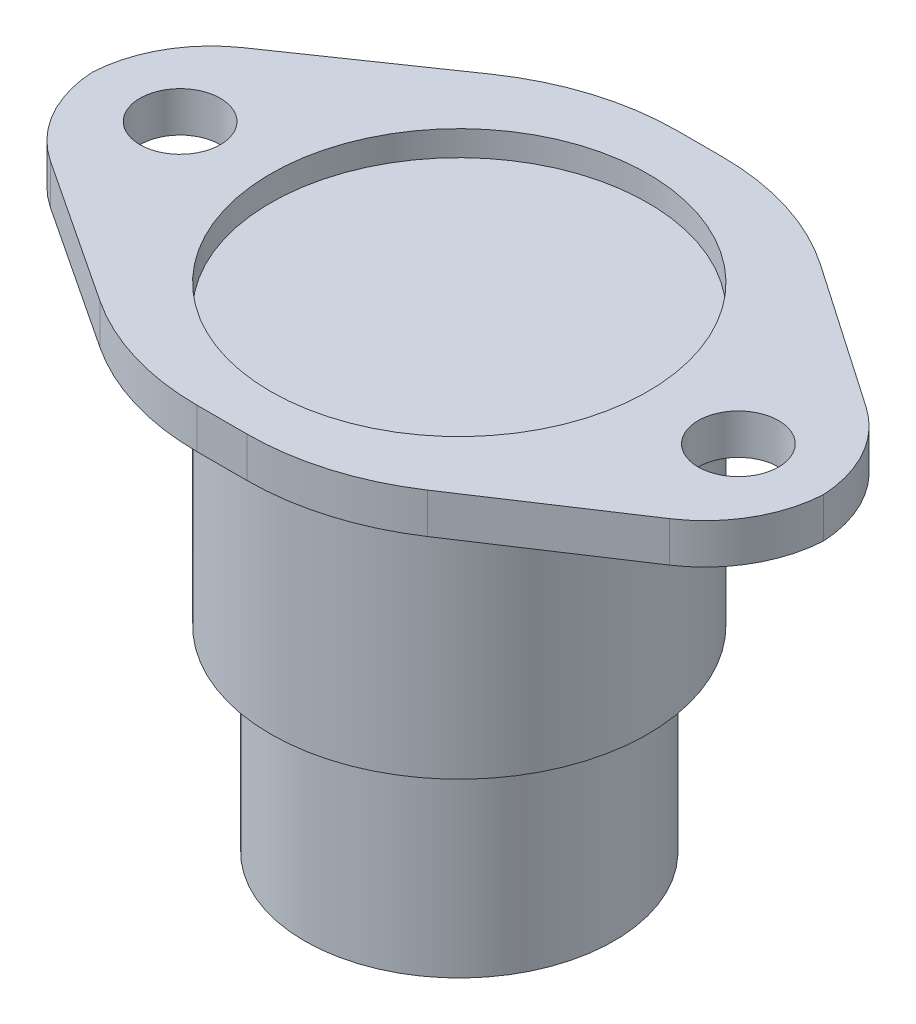
ISO-10303-21;
HEADER;
FILE_DESCRIPTION(('STEP AP214'),'2;1');
FILE_NAME('part.step','',(''),(''),'','','');
FILE_SCHEMA(('AUTOMOTIVE_DESIGN { 1 0 10303 214 1 1 1 1 }'));
ENDSEC;
DATA;
#1=APPLICATION_CONTEXT('core data for automotive mechanical design processes');
#2=APPLICATION_PROTOCOL_DEFINITION('international standard','automotive_design',2000,#1);
#3=PRODUCT_CONTEXT('',#1,'mechanical');
#4=PRODUCT('Part','Part','',(#3));
#5=PRODUCT_RELATED_PRODUCT_CATEGORY('part','',(#4));
#6=PRODUCT_DEFINITION_FORMATION('','',#4);
#7=PRODUCT_DEFINITION_CONTEXT('part definition',#1,'design');
#8=PRODUCT_DEFINITION('design','',#6,#7);
#9=PRODUCT_DEFINITION_SHAPE('','',#8);
#10=(LENGTH_UNIT() NAMED_UNIT(*) SI_UNIT(.MILLI.,.METRE.));
#11=(NAMED_UNIT(*) PLANE_ANGLE_UNIT() SI_UNIT($,.RADIAN.));
#12=(NAMED_UNIT(*) SI_UNIT($,.STERADIAN.) SOLID_ANGLE_UNIT());
#13=UNCERTAINTY_MEASURE_WITH_UNIT(LENGTH_MEASURE(1.E-05),#10,'distance_accuracy_value','');
#14=(GEOMETRIC_REPRESENTATION_CONTEXT(3) GLOBAL_UNCERTAINTY_ASSIGNED_CONTEXT((#13)) GLOBAL_UNIT_ASSIGNED_CONTEXT((#10,
#11,#12)) REPRESENTATION_CONTEXT('',''));
#15=CARTESIAN_POINT('',(0.,0.,0.));
#16=DIRECTION('',(0.,0.,1.));
#17=DIRECTION('',(1.,0.,0.));
#18=AXIS2_PLACEMENT_3D('',#15,#16,#17);
#19=CARTESIAN_POINT('',(0.,0.,0.));
#20=DIRECTION('',(0.,1.,0.));
#21=DIRECTION('',(0.,0.,1.));
#22=AXIS2_PLACEMENT_3D('',#19,#20,#21);
#23=PLANE('',#22);
#24=CARTESIAN_POINT('',(0.,0.,0.));
#25=DIRECTION('',(0.,1.,0.));
#26=DIRECTION('',(0.,0.,1.));
#27=AXIS2_PLACEMENT_3D('',#24,#25,#26);
#28=CIRCLE('',#27,7.5);
#29=CARTESIAN_POINT('',(0.,0.,7.5));
#30=VERTEX_POINT('',#29);
#31=EDGE_CURVE('E177',#30,#30,#28,.T.);
#32=ORIENTED_EDGE('',*,*,#31,.F.);
#33=EDGE_LOOP('',(#32));
#34=FACE_BOUND('',#33,.T.);
#35=CARTESIAN_POINT('',(0.,0.,0.));
#36=DIRECTION('',(0.,1.,0.));
#37=DIRECTION('',(0.,0.,1.));
#38=AXIS2_PLACEMENT_3D('',#35,#36,#37);
#39=CIRCLE('',#38,6.15);
#40=CARTESIAN_POINT('',(0.,0.,6.15));
#41=VERTEX_POINT('',#40);
#42=EDGE_CURVE('E158',#41,#41,#39,.F.);
#43=ORIENTED_EDGE('',*,*,#42,.F.);
#44=EDGE_LOOP('',(#43));
#45=FACE_BOUND('',#44,.T.);
#46=ADVANCED_FACE('F34',(#34,#45),#23,.F.);
#47=CARTESIAN_POINT('',(0.,10.2,0.));
#48=DIRECTION('',(0.,-1.,0.));
#49=DIRECTION('',(0.,0.,-1.));
#50=AXIS2_PLACEMENT_3D('',#47,#48,#49);
#51=CYLINDRICAL_SURFACE('',#50,7.5);
#52=CARTESIAN_POINT('',(0.,10.2,0.));
#53=DIRECTION('',(0.,1.,0.));
#54=DIRECTION('',(0.,0.,1.));
#55=AXIS2_PLACEMENT_3D('',#52,#53,#54);
#56=CIRCLE('',#55,7.5);
#57=CARTESIAN_POINT('',(0.,10.2,7.5));
#58=VERTEX_POINT('',#57);
#59=EDGE_CURVE('E174',#58,#58,#56,.T.);
#60=ORIENTED_EDGE('',*,*,#59,.F.);
#61=EDGE_LOOP('',(#60));
#62=FACE_BOUND('',#61,.T.);
#63=ORIENTED_EDGE('',*,*,#31,.T.);
#64=EDGE_LOOP('',(#63));
#65=FACE_BOUND('',#64,.T.);
#66=ADVANCED_FACE('F310',(#62,#65),#51,.T.);
#67=CARTESIAN_POINT('',(0.,10.2,0.));
#68=DIRECTION('',(0.,-1.,0.));
#69=DIRECTION('',(0.,0.,-1.));
#70=AXIS2_PLACEMENT_3D('',#67,#68,#69);
#71=PLANE('',#70);
#72=CARTESIAN_POINT('',(11.1,10.2,0.));
#73=DIRECTION('',(0.,1.,0.));
#74=DIRECTION('',(0.,0.,1.));
#75=AXIS2_PLACEMENT_3D('',#72,#73,#74);
#76=CIRCLE('',#75,1.6);
#77=CARTESIAN_POINT('',(11.1,10.2,1.6));
#78=VERTEX_POINT('',#77);
#79=EDGE_CURVE('E268',#78,#78,#76,.T.);
#80=ORIENTED_EDGE('',*,*,#79,.T.);
#81=EDGE_LOOP('',(#80));
#82=FACE_BOUND('',#81,.T.);
#83=DIRECTION('',(-1.,0.,0.));
#84=VECTOR('',#83,1.);
#85=CARTESIAN_POINT('',(4.,10.2,-9.56519593975598));
#86=LINE('',#85,#84);
#87=CARTESIAN_POINT('',(0.892310282869016,10.2,-9.56519593975598));
#88=VERTEX_POINT('',#87);
#89=CARTESIAN_POINT('',(-0.892310282869017,10.2,-9.56519593975598));
#90=VERTEX_POINT('',#89);
#91=EDGE_CURVE('E164',#88,#90,#86,.T.);
#92=ORIENTED_EDGE('',*,*,#91,.F.);
#93=CARTESIAN_POINT('',(0.892310282869016,10.2,0.434804060244022));
#94=DIRECTION('',(0.,-1.,0.));
#95=DIRECTION('',(0.,0.,-1.));
#96=AXIS2_PLACEMENT_3D('',#93,#94,#95);
#97=CIRCLE('',#96,10.);
#98=CARTESIAN_POINT('',(6.56029112602538,10.2,-7.80376336143874));
#99=VERTEX_POINT('',#98);
#100=EDGE_CURVE('E163',#88,#99,#97,.T.);
#101=ORIENTED_EDGE('',*,*,#100,.T.);
#102=DIRECTION('',(-0.823856742168276,0.,-0.566798084315636));
#103=VECTOR('',#102,1.);
#104=CARTESIAN_POINT('',(14.55,10.2,-2.30699256110524));
#105=LINE('',#104,#103);
#106=CARTESIAN_POINT('',(12.3839904215782,10.2,-3.79716678293378));
#107=VERTEX_POINT('',#106);
#108=EDGE_CURVE('E153',#107,#99,#105,.T.);
#109=ORIENTED_EDGE('',*,*,#108,.F.);
#110=CARTESIAN_POINT('',(9.55,10.2,0.322116927907595));
#111=DIRECTION('',(0.,-1.,0.));
#112=DIRECTION('',(0.,0.,-1.));
#113=AXIS2_PLACEMENT_3D('',#110,#111,#112);
#114=CIRCLE('',#113,5.);
#115=CARTESIAN_POINT('',(14.5425515681019,10.2,0.0493004330915872));
#116=VERTEX_POINT('',#115);
#117=EDGE_CURVE('E135',#107,#116,#114,.T.);
#118=ORIENTED_EDGE('',*,*,#117,.T.);
#119=CARTESIAN_POINT('',(9.55,10.2,-0.223516061724421));
#120=DIRECTION('',(0.,-1.,0.));
#121=DIRECTION('',(0.,0.,-1.));
#122=AXIS2_PLACEMENT_3D('',#119,#120,#121);
#123=CIRCLE('',#122,5.);
#124=CARTESIAN_POINT('',(12.3057833299247,10.2,3.94849283549875));
#125=VERTEX_POINT('',#124);
#126=EDGE_CURVE('E147',#116,#125,#123,.T.);
#127=ORIENTED_EDGE('',*,*,#126,.T.);
#128=DIRECTION('',(0.834401779444634,0.,-0.551156665984934));
#129=VECTOR('',#128,1.);
#130=CARTESIAN_POINT('',(4.,10.2,9.43480406024402));
#131=LINE('',#130,#129);
#132=CARTESIAN_POINT('',(6.50700859541159,10.2,7.77882185469036));
#133=VERTEX_POINT('',#132);
#134=EDGE_CURVE('E165',#133,#125,#131,.T.);
#135=ORIENTED_EDGE('',*,*,#134,.F.);
#136=CARTESIAN_POINT('',(0.995441935562247,10.2,-0.565195939755978));
#137=DIRECTION('',(0.,-1.,0.));
#138=DIRECTION('',(0.,0.,-1.));
#139=AXIS2_PLACEMENT_3D('',#136,#137,#138);
#140=CIRCLE('',#139,10.);
#141=CARTESIAN_POINT('',(0.995441935562245,10.2,9.43480406024402));
#142=VERTEX_POINT('',#141);
#143=EDGE_CURVE('E215',#133,#142,#140,.T.);
#144=ORIENTED_EDGE('',*,*,#143,.T.);
#145=DIRECTION('',(1.,0.,0.));
#146=VECTOR('',#145,1.);
#147=CARTESIAN_POINT('',(-4.,10.2,9.43480406024402));
#148=LINE('',#147,#146);
#149=CARTESIAN_POINT('',(-0.99544193556225,10.2,9.43480406024402));
#150=VERTEX_POINT('',#149);
#151=EDGE_CURVE('E170',#150,#142,#148,.T.);
#152=ORIENTED_EDGE('',*,*,#151,.F.);
#153=CARTESIAN_POINT('',(-0.995441935562248,10.2,-0.565195939755978));
#154=DIRECTION('',(0.,-1.,0.));
#155=DIRECTION('',(0.,0.,-1.));
#156=AXIS2_PLACEMENT_3D('',#153,#154,#155);
#157=CIRCLE('',#156,10.);
#158=CARTESIAN_POINT('',(-6.50700859541159,10.2,7.77882185469036));
#159=VERTEX_POINT('',#158);
#160=EDGE_CURVE('E213',#150,#159,#157,.T.);
#161=ORIENTED_EDGE('',*,*,#160,.T.);
#162=DIRECTION('',(0.834401779444634,0.,0.551156665984934));
#163=VECTOR('',#162,1.);
#164=CARTESIAN_POINT('',(-14.55,10.2,2.46609549635381));
#165=LINE('',#164,#163);
#166=CARTESIAN_POINT('',(-12.3057833299247,10.2,3.94849283549875));
#167=VERTEX_POINT('',#166);
#168=EDGE_CURVE('E246',#167,#159,#165,.T.);
#169=ORIENTED_EDGE('',*,*,#168,.F.);
#170=CARTESIAN_POINT('',(-9.55,10.2,-0.223516061724421));
#171=DIRECTION('',(0.,-1.,0.));
#172=DIRECTION('',(0.,0.,-1.));
#173=AXIS2_PLACEMENT_3D('',#170,#171,#172);
#174=CIRCLE('',#173,5.);
#175=CARTESIAN_POINT('',(-14.5425515681019,10.2,0.0493004330915873));
#176=VERTEX_POINT('',#175);
#177=EDGE_CURVE('E157',#167,#176,#174,.T.);
#178=ORIENTED_EDGE('',*,*,#177,.T.);
#179=CARTESIAN_POINT('',(-9.55,10.2,0.322116927907596));
#180=DIRECTION('',(0.,-1.,0.));
#181=DIRECTION('',(0.,0.,-1.));
#182=AXIS2_PLACEMENT_3D('',#179,#180,#181);
#183=CIRCLE('',#182,5.);
#184=CARTESIAN_POINT('',(-12.3839904215782,10.2,-3.79716678293378));
#185=VERTEX_POINT('',#184);
#186=EDGE_CURVE('E184',#176,#185,#183,.T.);
#187=ORIENTED_EDGE('',*,*,#186,.T.);
#188=DIRECTION('',(-0.823856742168276,0.,0.566798084315636));
#189=VECTOR('',#188,1.);
#190=CARTESIAN_POINT('',(-4.,10.2,-9.56519593975598));
#191=LINE('',#190,#189);
#192=CARTESIAN_POINT('',(-6.56029112602538,10.2,-7.80376336143873));
#193=VERTEX_POINT('',#192);
#194=EDGE_CURVE('E247',#193,#185,#191,.T.);
#195=ORIENTED_EDGE('',*,*,#194,.F.);
#196=CARTESIAN_POINT('',(-0.892310282869016,10.2,0.434804060244022));
#197=DIRECTION('',(0.,-1.,0.));
#198=DIRECTION('',(0.,0.,-1.));
#199=AXIS2_PLACEMENT_3D('',#196,#197,#198);
#200=CIRCLE('',#199,10.);
#201=EDGE_CURVE('E217',#193,#90,#200,.T.);
#202=ORIENTED_EDGE('',*,*,#201,.T.);
#203=EDGE_LOOP('',(#92,#101,#109,#118,#127,#135,#144,#152,#161,#169,#178,#187,#195,#202));
#204=FACE_BOUND('',#203,.T.);
#205=CARTESIAN_POINT('',(-11.1,10.2,0.));
#206=DIRECTION('',(0.,1.,0.));
#207=DIRECTION('',(0.,0.,1.));
#208=AXIS2_PLACEMENT_3D('',#205,#206,#207);
#209=CIRCLE('',#208,1.6);
#210=CARTESIAN_POINT('',(-11.1,10.2,1.6));
#211=VERTEX_POINT('',#210);
#212=EDGE_CURVE('E262',#211,#211,#209,.T.);
#213=ORIENTED_EDGE('',*,*,#212,.T.);
#214=EDGE_LOOP('',(#213));
#215=FACE_BOUND('',#214,.T.);
#216=ORIENTED_EDGE('',*,*,#59,.T.);
#217=EDGE_LOOP('',(#216));
#218=FACE_BOUND('',#217,.T.);
#219=ADVANCED_FACE('F161',(#82,#204,#215,#218),#71,.T.);
#220=CARTESIAN_POINT('',(0.,11.8,0.));
#221=DIRECTION('',(0.,-1.,0.));
#222=DIRECTION('',(0.,0.,-1.));
#223=AXIS2_PLACEMENT_3D('',#220,#221,#222);
#224=PLANE('',#223);
#225=CARTESIAN_POINT('',(0.,11.8,0.));
#226=DIRECTION('',(0.,1.,0.));
#227=DIRECTION('',(0.,0.,1.));
#228=AXIS2_PLACEMENT_3D('',#225,#226,#227);
#229=CIRCLE('',#228,7.5);
#230=CARTESIAN_POINT('',(0.,11.8,7.5));
#231=VERTEX_POINT('',#230);
#232=EDGE_CURVE('E205',#231,#231,#229,.T.);
#233=ORIENTED_EDGE('',*,*,#232,.F.);
#234=EDGE_LOOP('',(#233));
#235=FACE_BOUND('',#234,.T.);
#236=CARTESIAN_POINT('',(-11.1,11.8,0.));
#237=DIRECTION('',(0.,1.,0.));
#238=DIRECTION('',(0.,0.,1.));
#239=AXIS2_PLACEMENT_3D('',#236,#237,#238);
#240=CIRCLE('',#239,1.6);
#241=CARTESIAN_POINT('',(-11.1,11.8,1.6));
#242=VERTEX_POINT('',#241);
#243=EDGE_CURVE('E251',#242,#242,#240,.T.);
#244=ORIENTED_EDGE('',*,*,#243,.F.);
#245=EDGE_LOOP('',(#244));
#246=FACE_BOUND('',#245,.T.);
#247=DIRECTION('',(-0.823856742168276,0.,-0.566798084315636));
#248=VECTOR('',#247,1.);
#249=CARTESIAN_POINT('',(14.55,11.8,-2.30699256110524));
#250=LINE('',#249,#248);
#251=CARTESIAN_POINT('',(12.3839904215782,11.8,-3.79716678293378));
#252=VERTEX_POINT('',#251);
#253=CARTESIAN_POINT('',(6.56029112602538,11.8,-7.80376336143874));
#254=VERTEX_POINT('',#253);
#255=EDGE_CURVE('E156',#252,#254,#250,.T.);
#256=ORIENTED_EDGE('',*,*,#255,.T.);
#257=CARTESIAN_POINT('',(0.892310282869016,11.8,0.434804060244022));
#258=DIRECTION('',(0.,-1.,0.));
#259=DIRECTION('',(0.,0.,-1.));
#260=AXIS2_PLACEMENT_3D('',#257,#258,#259);
#261=CIRCLE('',#260,10.);
#262=CARTESIAN_POINT('',(0.892310282869016,11.8,-9.56519593975598));
#263=VERTEX_POINT('',#262);
#264=EDGE_CURVE('E227',#254,#263,#261,.F.);
#265=ORIENTED_EDGE('',*,*,#264,.T.);
#266=DIRECTION('',(-1.,0.,0.));
#267=VECTOR('',#266,1.);
#268=CARTESIAN_POINT('',(4.,11.8,-9.56519593975598));
#269=LINE('',#268,#267);
#270=CARTESIAN_POINT('',(-0.892310282869017,11.8,-9.56519593975598));
#271=VERTEX_POINT('',#270);
#272=EDGE_CURVE('E180',#263,#271,#269,.T.);
#273=ORIENTED_EDGE('',*,*,#272,.T.);
#274=CARTESIAN_POINT('',(-0.892310282869016,11.8,0.434804060244022));
#275=DIRECTION('',(0.,-1.,0.));
#276=DIRECTION('',(0.,0.,-1.));
#277=AXIS2_PLACEMENT_3D('',#274,#275,#276);
#278=CIRCLE('',#277,10.);
#279=CARTESIAN_POINT('',(-6.56029112602538,11.8,-7.80376336143873));
#280=VERTEX_POINT('',#279);
#281=EDGE_CURVE('E225',#271,#280,#278,.F.);
#282=ORIENTED_EDGE('',*,*,#281,.T.);
#283=DIRECTION('',(-0.823856742168276,0.,0.566798084315636));
#284=VECTOR('',#283,1.);
#285=CARTESIAN_POINT('',(-4.,11.8,-9.56519593975598));
#286=LINE('',#285,#284);
#287=CARTESIAN_POINT('',(-12.3839904215782,11.8,-3.79716678293378));
#288=VERTEX_POINT('',#287);
#289=EDGE_CURVE('E168',#280,#288,#286,.T.);
#290=ORIENTED_EDGE('',*,*,#289,.T.);
#291=CARTESIAN_POINT('',(-9.55,11.8,0.322116927907596));
#292=DIRECTION('',(0.,-1.,0.));
#293=DIRECTION('',(0.,0.,-1.));
#294=AXIS2_PLACEMENT_3D('',#291,#292,#293);
#295=CIRCLE('',#294,5.);
#296=CARTESIAN_POINT('',(-14.5425515681019,11.8,0.0493004330915873));
#297=VERTEX_POINT('',#296);
#298=EDGE_CURVE('E189',#288,#297,#295,.F.);
#299=ORIENTED_EDGE('',*,*,#298,.T.);
#300=CARTESIAN_POINT('',(-9.55,11.8,-0.223516061724421));
#301=DIRECTION('',(0.,-1.,0.));
#302=DIRECTION('',(0.,0.,-1.));
#303=AXIS2_PLACEMENT_3D('',#300,#301,#302);
#304=CIRCLE('',#303,5.);
#305=CARTESIAN_POINT('',(-12.3057833299247,11.8,3.94849283549875));
#306=VERTEX_POINT('',#305);
#307=EDGE_CURVE('E146',#297,#306,#304,.F.);
#308=ORIENTED_EDGE('',*,*,#307,.T.);
#309=DIRECTION('',(0.834401779444634,0.,0.551156665984934));
#310=VECTOR('',#309,1.);
#311=CARTESIAN_POINT('',(-14.55,11.8,2.46609549635381));
#312=LINE('',#311,#310);
#313=CARTESIAN_POINT('',(-6.50700859541159,11.8,7.77882185469036));
#314=VERTEX_POINT('',#313);
#315=EDGE_CURVE('E258',#306,#314,#312,.T.);
#316=ORIENTED_EDGE('',*,*,#315,.T.);
#317=CARTESIAN_POINT('',(-0.995441935562248,11.8,-0.565195939755978));
#318=DIRECTION('',(0.,-1.,0.));
#319=DIRECTION('',(0.,0.,-1.));
#320=AXIS2_PLACEMENT_3D('',#317,#318,#319);
#321=CIRCLE('',#320,10.);
#322=CARTESIAN_POINT('',(-0.99544193556225,11.8,9.43480406024402));
#323=VERTEX_POINT('',#322);
#324=EDGE_CURVE('E222',#314,#323,#321,.F.);
#325=ORIENTED_EDGE('',*,*,#324,.T.);
#326=DIRECTION('',(1.,0.,0.));
#327=VECTOR('',#326,1.);
#328=CARTESIAN_POINT('',(-4.,11.8,9.43480406024402));
#329=LINE('',#328,#327);
#330=CARTESIAN_POINT('',(0.995441935562245,11.8,9.43480406024402));
#331=VERTEX_POINT('',#330);
#332=EDGE_CURVE('E240',#323,#331,#329,.T.);
#333=ORIENTED_EDGE('',*,*,#332,.T.);
#334=CARTESIAN_POINT('',(0.995441935562247,11.8,-0.565195939755978));
#335=DIRECTION('',(0.,-1.,0.));
#336=DIRECTION('',(0.,0.,-1.));
#337=AXIS2_PLACEMENT_3D('',#334,#335,#336);
#338=CIRCLE('',#337,10.);
#339=CARTESIAN_POINT('',(6.50700859541159,11.8,7.77882185469036));
#340=VERTEX_POINT('',#339);
#341=EDGE_CURVE('E49',#331,#340,#338,.F.);
#342=ORIENTED_EDGE('',*,*,#341,.T.);
#343=DIRECTION('',(0.834401779444634,0.,-0.551156665984934));
#344=VECTOR('',#343,1.);
#345=CARTESIAN_POINT('',(4.,11.8,9.43480406024402));
#346=LINE('',#345,#344);
#347=CARTESIAN_POINT('',(12.3057833299247,11.8,3.94849283549875));
#348=VERTEX_POINT('',#347);
#349=EDGE_CURVE('E255',#340,#348,#346,.T.);
#350=ORIENTED_EDGE('',*,*,#349,.T.);
#351=CARTESIAN_POINT('',(9.55,11.8,-0.223516061724421));
#352=DIRECTION('',(0.,-1.,0.));
#353=DIRECTION('',(0.,0.,-1.));
#354=AXIS2_PLACEMENT_3D('',#351,#352,#353);
#355=CIRCLE('',#354,5.);
#356=CARTESIAN_POINT('',(14.5425515681019,11.8,0.0493004330915872));
#357=VERTEX_POINT('',#356);
#358=EDGE_CURVE('E191',#348,#357,#355,.F.);
#359=ORIENTED_EDGE('',*,*,#358,.T.);
#360=CARTESIAN_POINT('',(9.55,11.8,0.322116927907595));
#361=DIRECTION('',(0.,-1.,0.));
#362=DIRECTION('',(0.,0.,-1.));
#363=AXIS2_PLACEMENT_3D('',#360,#361,#362);
#364=CIRCLE('',#363,5.);
#365=EDGE_CURVE('E193',#357,#252,#364,.F.);
#366=ORIENTED_EDGE('',*,*,#365,.T.);
#367=EDGE_LOOP('',(#256,#265,#273,#282,#290,#299,#308,#316,#325,#333,#342,#350,#359,#366));
#368=FACE_BOUND('',#367,.T.);
#369=CARTESIAN_POINT('',(11.1,11.8,0.));
#370=DIRECTION('',(0.,1.,0.));
#371=DIRECTION('',(0.,0.,1.));
#372=AXIS2_PLACEMENT_3D('',#369,#370,#371);
#373=CIRCLE('',#372,1.6);
#374=CARTESIAN_POINT('',(11.1,11.8,1.6));
#375=VERTEX_POINT('',#374);
#376=EDGE_CURVE('E265',#375,#375,#373,.T.);
#377=ORIENTED_EDGE('',*,*,#376,.F.);
#378=EDGE_LOOP('',(#377));
#379=FACE_BOUND('',#378,.T.);
#380=ADVANCED_FACE('F291',(#235,#246,#368,#379),#224,.F.);
#381=CARTESIAN_POINT('',(-4.,11.8,-9.56519593975598));
#382=DIRECTION('',(0.566798084315636,0.,0.823856742168276));
#383=DIRECTION('',(0.823856742168276,0.,-0.566798084315636));
#384=AXIS2_PLACEMENT_3D('',#381,#382,#383);
#385=PLANE('',#384);
#386=ORIENTED_EDGE('',*,*,#289,.F.);
#387=DIRECTION('',(0.,-1.,0.));
#388=VECTOR('',#387,1.);
#389=CARTESIAN_POINT('',(-6.56029112602538,11.8,-7.80376336143873));
#390=LINE('',#389,#388);
#391=EDGE_CURVE('E229',#280,#193,#390,.T.);
#392=ORIENTED_EDGE('',*,*,#391,.T.);
#393=ORIENTED_EDGE('',*,*,#194,.T.);
#394=DIRECTION('',(0.,-1.,0.));
#395=VECTOR('',#394,1.);
#396=CARTESIAN_POINT('',(-12.3839904215782,11.8,-3.79716678293378));
#397=LINE('',#396,#395);
#398=EDGE_CURVE('E198',#185,#288,#397,.F.);
#399=ORIENTED_EDGE('',*,*,#398,.T.);
#400=EDGE_LOOP('',(#386,#392,#393,#399));
#401=FACE_BOUND('',#400,.T.);
#402=ADVANCED_FACE('F294',(#401),#385,.F.);
#403=CARTESIAN_POINT('',(-14.55,11.8,2.46609549635381));
#404=DIRECTION('',(0.551156665984934,0.,-0.834401779444634));
#405=DIRECTION('',(-0.834401779444634,0.,-0.551156665984934));
#406=AXIS2_PLACEMENT_3D('',#403,#404,#405);
#407=PLANE('',#406);
#408=ORIENTED_EDGE('',*,*,#168,.T.);
#409=DIRECTION('',(0.,-1.,0.));
#410=VECTOR('',#409,1.);
#411=CARTESIAN_POINT('',(-6.50700859541159,11.8,7.77882185469036));
#412=LINE('',#411,#410);
#413=EDGE_CURVE('E11',#159,#314,#412,.F.);
#414=ORIENTED_EDGE('',*,*,#413,.T.);
#415=ORIENTED_EDGE('',*,*,#315,.F.);
#416=DIRECTION('',(0.,-1.,0.));
#417=VECTOR('',#416,1.);
#418=CARTESIAN_POINT('',(-12.3057833299247,11.8,3.94849283549875));
#419=LINE('',#418,#417);
#420=EDGE_CURVE('E201',#306,#167,#419,.T.);
#421=ORIENTED_EDGE('',*,*,#420,.T.);
#422=EDGE_LOOP('',(#408,#414,#415,#421));
#423=FACE_BOUND('',#422,.T.);
#424=ADVANCED_FACE('F368',(#423),#407,.F.);
#425=CARTESIAN_POINT('',(-4.,11.8,9.43480406024402));
#426=DIRECTION('',(0.,0.,-1.));
#427=DIRECTION('',(-1.,0.,0.));
#428=AXIS2_PLACEMENT_3D('',#425,#426,#427);
#429=PLANE('',#428);
#430=ORIENTED_EDGE('',*,*,#151,.T.);
#431=DIRECTION('',(0.,-1.,0.));
#432=VECTOR('',#431,1.);
#433=CARTESIAN_POINT('',(0.995441935562245,11.8,9.43480406024402));
#434=LINE('',#433,#432);
#435=EDGE_CURVE('E42',#142,#331,#434,.F.);
#436=ORIENTED_EDGE('',*,*,#435,.T.);
#437=ORIENTED_EDGE('',*,*,#332,.F.);
#438=DIRECTION('',(0.,-1.,0.));
#439=VECTOR('',#438,1.);
#440=CARTESIAN_POINT('',(-0.99544193556225,11.8,9.43480406024402));
#441=LINE('',#440,#439);
#442=EDGE_CURVE('E235',#323,#150,#441,.T.);
#443=ORIENTED_EDGE('',*,*,#442,.T.);
#444=EDGE_LOOP('',(#430,#436,#437,#443));
#445=FACE_BOUND('',#444,.T.);
#446=ADVANCED_FACE('F239',(#445),#429,.F.);
#447=CARTESIAN_POINT('',(4.,11.8,9.43480406024402));
#448=DIRECTION('',(-0.551156665984934,0.,-0.834401779444634));
#449=DIRECTION('',(-0.834401779444634,0.,0.551156665984934));
#450=AXIS2_PLACEMENT_3D('',#447,#448,#449);
#451=PLANE('',#450);
#452=ORIENTED_EDGE('',*,*,#349,.F.);
#453=DIRECTION('',(0.,-1.,0.));
#454=VECTOR('',#453,1.);
#455=CARTESIAN_POINT('',(6.50700859541159,11.8,7.77882185469036));
#456=LINE('',#455,#454);
#457=EDGE_CURVE('E232',#340,#133,#456,.T.);
#458=ORIENTED_EDGE('',*,*,#457,.T.);
#459=ORIENTED_EDGE('',*,*,#134,.T.);
#460=DIRECTION('',(0.,-1.,0.));
#461=VECTOR('',#460,1.);
#462=CARTESIAN_POINT('',(12.3057833299247,11.8,3.94849283549875));
#463=LINE('',#462,#461);
#464=EDGE_CURVE('E195',#125,#348,#463,.F.);
#465=ORIENTED_EDGE('',*,*,#464,.T.);
#466=EDGE_LOOP('',(#452,#458,#459,#465));
#467=FACE_BOUND('',#466,.T.);
#468=ADVANCED_FACE('F357',(#467),#451,.F.);
#469=CARTESIAN_POINT('',(14.55,11.8,-2.30699256110524));
#470=DIRECTION('',(-0.566798084315636,0.,0.823856742168276));
#471=DIRECTION('',(0.823856742168276,0.,0.566798084315636));
#472=AXIS2_PLACEMENT_3D('',#469,#470,#471);
#473=PLANE('',#472);
#474=ORIENTED_EDGE('',*,*,#108,.T.);
#475=DIRECTION('',(0.,-1.,0.));
#476=VECTOR('',#475,1.);
#477=CARTESIAN_POINT('',(6.56029112602538,11.8,-7.80376336143874));
#478=LINE('',#477,#476);
#479=EDGE_CURVE('E220',#99,#254,#478,.F.);
#480=ORIENTED_EDGE('',*,*,#479,.T.);
#481=ORIENTED_EDGE('',*,*,#255,.F.);
#482=DIRECTION('',(0.,-1.,0.));
#483=VECTOR('',#482,1.);
#484=CARTESIAN_POINT('',(12.3839904215782,11.8,-3.79716678293378));
#485=LINE('',#484,#483);
#486=EDGE_CURVE('E139',#252,#107,#485,.T.);
#487=ORIENTED_EDGE('',*,*,#486,.T.);
#488=EDGE_LOOP('',(#474,#480,#481,#487));
#489=FACE_BOUND('',#488,.T.);
#490=ADVANCED_FACE('F152',(#489),#473,.F.);
#491=CARTESIAN_POINT('',(4.,11.8,-9.56519593975598));
#492=DIRECTION('',(0.,0.,1.));
#493=DIRECTION('',(1.,0.,0.));
#494=AXIS2_PLACEMENT_3D('',#491,#492,#493);
#495=PLANE('',#494);
#496=ORIENTED_EDGE('',*,*,#272,.F.);
#497=DIRECTION('',(0.,-1.,0.));
#498=VECTOR('',#497,1.);
#499=CARTESIAN_POINT('',(0.892310282869016,11.8,-9.56519593975598));
#500=LINE('',#499,#498);
#501=EDGE_CURVE('E210',#263,#88,#500,.T.);
#502=ORIENTED_EDGE('',*,*,#501,.T.);
#503=ORIENTED_EDGE('',*,*,#91,.T.);
#504=DIRECTION('',(0.,-1.,0.));
#505=VECTOR('',#504,1.);
#506=CARTESIAN_POINT('',(-0.892310282869017,11.8,-9.56519593975598));
#507=LINE('',#506,#505);
#508=EDGE_CURVE('E203',#90,#271,#507,.F.);
#509=ORIENTED_EDGE('',*,*,#508,.T.);
#510=EDGE_LOOP('',(#496,#502,#503,#509));
#511=FACE_BOUND('',#510,.T.);
#512=ADVANCED_FACE('F366',(#511),#495,.F.);
#513=CARTESIAN_POINT('',(-11.1,11.8,0.));
#514=DIRECTION('',(0.,-1.,0.));
#515=DIRECTION('',(0.,0.,-1.));
#516=AXIS2_PLACEMENT_3D('',#513,#514,#515);
#517=CYLINDRICAL_SURFACE('',#516,1.6);
#518=ORIENTED_EDGE('',*,*,#243,.T.);
#519=EDGE_LOOP('',(#518));
#520=FACE_BOUND('',#519,.T.);
#521=ORIENTED_EDGE('',*,*,#212,.F.);
#522=EDGE_LOOP('',(#521));
#523=FACE_BOUND('',#522,.T.);
#524=ADVANCED_FACE('F305',(#520,#523),#517,.F.);
#525=CARTESIAN_POINT('',(11.1,11.8,0.));
#526=DIRECTION('',(0.,-1.,0.));
#527=DIRECTION('',(0.,0.,-1.));
#528=AXIS2_PLACEMENT_3D('',#525,#526,#527);
#529=CYLINDRICAL_SURFACE('',#528,1.6);
#530=ORIENTED_EDGE('',*,*,#376,.T.);
#531=EDGE_LOOP('',(#530));
#532=FACE_BOUND('',#531,.T.);
#533=ORIENTED_EDGE('',*,*,#79,.F.);
#534=EDGE_LOOP('',(#533));
#535=FACE_BOUND('',#534,.T.);
#536=ADVANCED_FACE('F301',(#532,#535),#529,.F.);
#537=CARTESIAN_POINT('',(0.,-7.8,0.));
#538=DIRECTION('',(0.,1.,0.));
#539=DIRECTION('',(0.,0.,1.));
#540=AXIS2_PLACEMENT_3D('',#537,#538,#539);
#541=CYLINDRICAL_SURFACE('',#540,6.15);
#542=CARTESIAN_POINT('',(0.,-7.8,0.));
#543=DIRECTION('',(0.,-1.,0.));
#544=DIRECTION('',(0.,0.,-1.));
#545=AXIS2_PLACEMENT_3D('',#542,#543,#544);
#546=CIRCLE('',#545,6.15);
#547=CARTESIAN_POINT('',(0.,-7.8,-6.15));
#548=VERTEX_POINT('',#547);
#549=EDGE_CURVE('E271',#548,#548,#546,.T.);
#550=ORIENTED_EDGE('',*,*,#549,.F.);
#551=EDGE_LOOP('',(#550));
#552=FACE_BOUND('',#551,.T.);
#553=ORIENTED_EDGE('',*,*,#42,.T.);
#554=EDGE_LOOP('',(#553));
#555=FACE_BOUND('',#554,.T.);
#556=ADVANCED_FACE('F304',(#552,#555),#541,.T.);
#557=CARTESIAN_POINT('',(0.,-7.8,0.));
#558=DIRECTION('',(0.,-1.,0.));
#559=DIRECTION('',(0.,0.,-1.));
#560=AXIS2_PLACEMENT_3D('',#557,#558,#559);
#561=PLANE('',#560);
#562=ORIENTED_EDGE('',*,*,#549,.T.);
#563=EDGE_LOOP('',(#562));
#564=FACE_BOUND('',#563,.T.);
#565=ADVANCED_FACE('F287',(#564),#561,.T.);
#566=CARTESIAN_POINT('',(0.,10.8,0.));
#567=DIRECTION('',(0.,1.,0.));
#568=DIRECTION('',(0.,0.,1.));
#569=AXIS2_PLACEMENT_3D('',#566,#567,#568);
#570=CYLINDRICAL_SURFACE('',#569,7.5);
#571=CARTESIAN_POINT('',(0.,10.8,0.));
#572=DIRECTION('',(0.,1.,0.));
#573=DIRECTION('',(0.,0.,1.));
#574=AXIS2_PLACEMENT_3D('',#571,#572,#573);
#575=CIRCLE('',#574,7.5);
#576=CARTESIAN_POINT('',(0.,10.8,7.5));
#577=VERTEX_POINT('',#576);
#578=EDGE_CURVE('E276',#577,#577,#575,.T.);
#579=ORIENTED_EDGE('',*,*,#578,.F.);
#580=EDGE_LOOP('',(#579));
#581=FACE_BOUND('',#580,.T.);
#582=ORIENTED_EDGE('',*,*,#232,.T.);
#583=EDGE_LOOP('',(#582));
#584=FACE_BOUND('',#583,.T.);
#585=ADVANCED_FACE('F284',(#581,#584),#570,.F.);
#586=CARTESIAN_POINT('',(0.,10.8,0.));
#587=DIRECTION('',(0.,1.,0.));
#588=DIRECTION('',(0.,0.,1.));
#589=AXIS2_PLACEMENT_3D('',#586,#587,#588);
#590=PLANE('',#589);
#591=ORIENTED_EDGE('',*,*,#578,.T.);
#592=EDGE_LOOP('',(#591));
#593=FACE_BOUND('',#592,.T.);
#594=ADVANCED_FACE('F282',(#593),#590,.T.);
#595=CARTESIAN_POINT('',(9.55,11.8,-0.223516061724421));
#596=DIRECTION('',(0.,-1.,0.));
#597=DIRECTION('',(0.,0.,-1.));
#598=AXIS2_PLACEMENT_3D('',#595,#596,#597);
#599=CYLINDRICAL_SURFACE('',#598,5.);
#600=DIRECTION('',(0.,-1.,0.));
#601=VECTOR('',#600,1.);
#602=CARTESIAN_POINT('',(14.5425515681019,11.,0.0493004330915871));
#603=LINE('',#602,#601);
#604=EDGE_CURVE('E141',#357,#116,#603,.T.);
#605=ORIENTED_EDGE('',*,*,#604,.F.);
#606=ORIENTED_EDGE('',*,*,#358,.F.);
#607=ORIENTED_EDGE('',*,*,#464,.F.);
#608=ORIENTED_EDGE('',*,*,#126,.F.);
#609=EDGE_LOOP('',(#605,#606,#607,#608));
#610=FACE_BOUND('',#609,.T.);
#611=ADVANCED_FACE('F331',(#610),#599,.T.);
#612=CARTESIAN_POINT('',(9.55,11.8,0.322116927907595));
#613=DIRECTION('',(0.,-1.,0.));
#614=DIRECTION('',(0.,0.,-1.));
#615=AXIS2_PLACEMENT_3D('',#612,#613,#614);
#616=CYLINDRICAL_SURFACE('',#615,5.);
#617=ORIENTED_EDGE('',*,*,#365,.F.);
#618=ORIENTED_EDGE('',*,*,#604,.T.);
#619=ORIENTED_EDGE('',*,*,#117,.F.);
#620=ORIENTED_EDGE('',*,*,#486,.F.);
#621=EDGE_LOOP('',(#617,#618,#619,#620));
#622=FACE_BOUND('',#621,.T.);
#623=ADVANCED_FACE('F138',(#622),#616,.T.);
#624=CARTESIAN_POINT('',(-9.55,11.8,-0.223516061724421));
#625=DIRECTION('',(0.,-1.,0.));
#626=DIRECTION('',(0.,0.,-1.));
#627=AXIS2_PLACEMENT_3D('',#624,#625,#626);
#628=CYLINDRICAL_SURFACE('',#627,5.);
#629=ORIENTED_EDGE('',*,*,#420,.F.);
#630=ORIENTED_EDGE('',*,*,#307,.F.);
#631=DIRECTION('',(0.,-1.,0.));
#632=VECTOR('',#631,1.);
#633=CARTESIAN_POINT('',(-14.5425515681019,11.,0.0493004330915872));
#634=LINE('',#633,#632);
#635=EDGE_CURVE('E206',#176,#297,#634,.F.);
#636=ORIENTED_EDGE('',*,*,#635,.F.);
#637=ORIENTED_EDGE('',*,*,#177,.F.);
#638=EDGE_LOOP('',(#629,#630,#636,#637));
#639=FACE_BOUND('',#638,.T.);
#640=ADVANCED_FACE('F330',(#639),#628,.T.);
#641=CARTESIAN_POINT('',(-9.55,11.8,0.322116927907596));
#642=DIRECTION('',(0.,-1.,0.));
#643=DIRECTION('',(0.,0.,-1.));
#644=AXIS2_PLACEMENT_3D('',#641,#642,#643);
#645=CYLINDRICAL_SURFACE('',#644,5.);
#646=ORIENTED_EDGE('',*,*,#298,.F.);
#647=ORIENTED_EDGE('',*,*,#398,.F.);
#648=ORIENTED_EDGE('',*,*,#186,.F.);
#649=ORIENTED_EDGE('',*,*,#635,.T.);
#650=EDGE_LOOP('',(#646,#647,#648,#649));
#651=FACE_BOUND('',#650,.T.);
#652=ADVANCED_FACE('F335',(#651),#645,.T.);
#653=CARTESIAN_POINT('',(0.892310282869016,11.8,0.434804060244022));
#654=DIRECTION('',(0.,-1.,0.));
#655=DIRECTION('',(0.,0.,-1.));
#656=AXIS2_PLACEMENT_3D('',#653,#654,#655);
#657=CYLINDRICAL_SURFACE('',#656,10.);
#658=ORIENTED_EDGE('',*,*,#264,.F.);
#659=ORIENTED_EDGE('',*,*,#479,.F.);
#660=ORIENTED_EDGE('',*,*,#100,.F.);
#661=ORIENTED_EDGE('',*,*,#501,.F.);
#662=EDGE_LOOP('',(#658,#659,#660,#661));
#663=FACE_BOUND('',#662,.T.);
#664=ADVANCED_FACE('F338',(#663),#657,.T.);
#665=CARTESIAN_POINT('',(-0.892310282869016,11.8,0.434804060244022));
#666=DIRECTION('',(0.,-1.,0.));
#667=DIRECTION('',(0.,0.,-1.));
#668=AXIS2_PLACEMENT_3D('',#665,#666,#667);
#669=CYLINDRICAL_SURFACE('',#668,10.);
#670=ORIENTED_EDGE('',*,*,#281,.F.);
#671=ORIENTED_EDGE('',*,*,#508,.F.);
#672=ORIENTED_EDGE('',*,*,#201,.F.);
#673=ORIENTED_EDGE('',*,*,#391,.F.);
#674=EDGE_LOOP('',(#670,#671,#672,#673));
#675=FACE_BOUND('',#674,.T.);
#676=ADVANCED_FACE('F345',(#675),#669,.T.);
#677=CARTESIAN_POINT('',(0.995441935562247,11.8,-0.565195939755978));
#678=DIRECTION('',(0.,-1.,0.));
#679=DIRECTION('',(0.,0.,-1.));
#680=AXIS2_PLACEMENT_3D('',#677,#678,#679);
#681=CYLINDRICAL_SURFACE('',#680,10.);
#682=ORIENTED_EDGE('',*,*,#341,.F.);
#683=ORIENTED_EDGE('',*,*,#435,.F.);
#684=ORIENTED_EDGE('',*,*,#143,.F.);
#685=ORIENTED_EDGE('',*,*,#457,.F.);
#686=EDGE_LOOP('',(#682,#683,#684,#685));
#687=FACE_BOUND('',#686,.T.);
#688=ADVANCED_FACE('F348',(#687),#681,.T.);
#689=CARTESIAN_POINT('',(-0.995441935562248,11.8,-0.565195939755978));
#690=DIRECTION('',(0.,-1.,0.));
#691=DIRECTION('',(0.,0.,-1.));
#692=AXIS2_PLACEMENT_3D('',#689,#690,#691);
#693=CYLINDRICAL_SURFACE('',#692,10.);
#694=ORIENTED_EDGE('',*,*,#324,.F.);
#695=ORIENTED_EDGE('',*,*,#413,.F.);
#696=ORIENTED_EDGE('',*,*,#160,.F.);
#697=ORIENTED_EDGE('',*,*,#442,.F.);
#698=EDGE_LOOP('',(#694,#695,#696,#697));
#699=FACE_BOUND('',#698,.T.);
#700=ADVANCED_FACE('F36',(#699),#693,.T.);
#701=CLOSED_SHELL('',(#46,#66,#219,#380,#402,#424,#446,#468,#490,#512,#524,#536,#556,#565,#585,
#594,#611,#623,#640,#652,#664,#676,#688,#700));
#702=MANIFOLD_SOLID_BREP('B2',#701);
#703=ADVANCED_BREP_SHAPE_REPRESENTATION('',(#18,#702),#14);
#704=SHAPE_DEFINITION_REPRESENTATION(#9,#703);
ENDSEC;
END-ISO-10303-21;
